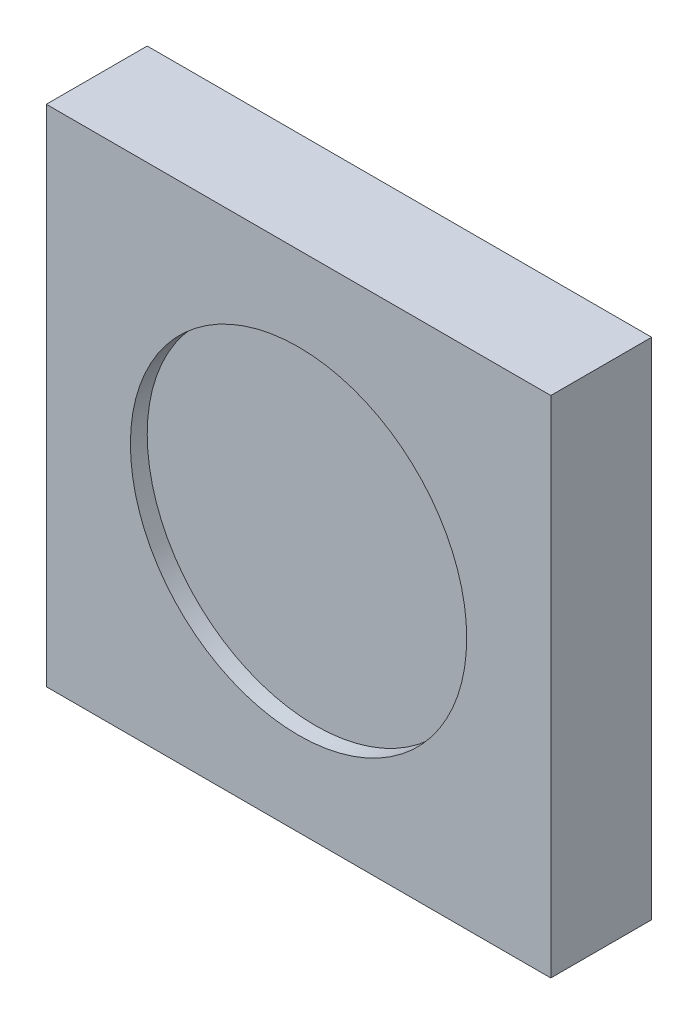
ISO-10303-21;
HEADER;
FILE_DESCRIPTION(('STEP AP214'),'2;1');
FILE_NAME('part.step','',(''),(''),'','','');
FILE_SCHEMA(('AUTOMOTIVE_DESIGN { 1 0 10303 214 1 1 1 1 }'));
ENDSEC;
DATA;
#1=APPLICATION_CONTEXT('core data for automotive mechanical design processes');
#2=APPLICATION_PROTOCOL_DEFINITION('international standard','automotive_design',2000,#1);
#3=PRODUCT_CONTEXT('',#1,'mechanical');
#4=PRODUCT('Part','Part','',(#3));
#5=PRODUCT_RELATED_PRODUCT_CATEGORY('part','',(#4));
#6=PRODUCT_DEFINITION_FORMATION('','',#4);
#7=PRODUCT_DEFINITION_CONTEXT('part definition',#1,'design');
#8=PRODUCT_DEFINITION('design','',#6,#7);
#9=PRODUCT_DEFINITION_SHAPE('','',#8);
#10=(LENGTH_UNIT() NAMED_UNIT(*) SI_UNIT(.MILLI.,.METRE.));
#11=(NAMED_UNIT(*) PLANE_ANGLE_UNIT() SI_UNIT($,.RADIAN.));
#12=(NAMED_UNIT(*) SI_UNIT($,.STERADIAN.) SOLID_ANGLE_UNIT());
#13=UNCERTAINTY_MEASURE_WITH_UNIT(LENGTH_MEASURE(1.E-05),#10,'distance_accuracy_value','');
#14=(GEOMETRIC_REPRESENTATION_CONTEXT(3) GLOBAL_UNCERTAINTY_ASSIGNED_CONTEXT((#13)) GLOBAL_UNIT_ASSIGNED_CONTEXT((#10,
#11,#12)) REPRESENTATION_CONTEXT('',''));
#15=CARTESIAN_POINT('',(0.,0.,0.));
#16=DIRECTION('',(0.,0.,1.));
#17=DIRECTION('',(1.,0.,0.));
#18=AXIS2_PLACEMENT_3D('',#15,#16,#17);
#19=CARTESIAN_POINT('',(-169.212810174458,34.7545635375068,6.));
#20=DIRECTION('',(1.,0.,0.));
#21=DIRECTION('',(0.,0.,-1.));
#22=AXIS2_PLACEMENT_3D('',#19,#20,#21);
#23=PLANE('',#22);
#24=DIRECTION('',(0.,-1.,0.));
#25=VECTOR('',#24,1.);
#26=CARTESIAN_POINT('',(-169.212810174458,34.7545635375068,0.));
#27=LINE('',#26,#25);
#28=CARTESIAN_POINT('',(-169.212810174458,34.7545635375068,0.));
#29=VERTEX_POINT('',#28);
#30=CARTESIAN_POINT('',(-169.212810174458,4.75456353750676,0.));
#31=VERTEX_POINT('',#30);
#32=EDGE_CURVE('E102',#29,#31,#27,.T.);
#33=ORIENTED_EDGE('',*,*,#32,.T.);
#34=DIRECTION('',(0.,0.,-1.));
#35=VECTOR('',#34,1.);
#36=CARTESIAN_POINT('',(-169.212810174458,4.75456353750676,6.));
#37=LINE('',#36,#35);
#38=CARTESIAN_POINT('',(-169.212810174458,4.75456353750676,6.));
#39=VERTEX_POINT('',#38);
#40=EDGE_CURVE('E11',#39,#31,#37,.T.);
#41=ORIENTED_EDGE('',*,*,#40,.F.);
#42=DIRECTION('',(0.,-1.,0.));
#43=VECTOR('',#42,1.);
#44=CARTESIAN_POINT('',(-169.212810174458,34.7545635375068,6.));
#45=LINE('',#44,#43);
#46=CARTESIAN_POINT('',(-169.212810174458,34.7545635375068,6.));
#47=VERTEX_POINT('',#46);
#48=EDGE_CURVE('E90',#47,#39,#45,.T.);
#49=ORIENTED_EDGE('',*,*,#48,.F.);
#50=DIRECTION('',(0.,0.,-1.));
#51=VECTOR('',#50,1.);
#52=CARTESIAN_POINT('',(-169.212810174458,34.7545635375068,6.));
#53=LINE('',#52,#51);
#54=EDGE_CURVE('E98',#47,#29,#53,.T.);
#55=ORIENTED_EDGE('',*,*,#54,.T.);
#56=EDGE_LOOP('',(#33,#41,#49,#55));
#57=FACE_BOUND('',#56,.T.);
#58=ADVANCED_FACE('F39',(#57),#23,.F.);
#59=CARTESIAN_POINT('',(-169.212810174458,4.75456353750676,6.));
#60=DIRECTION('',(0.,1.,0.));
#61=DIRECTION('',(0.,0.,1.));
#62=AXIS2_PLACEMENT_3D('',#59,#60,#61);
#63=PLANE('',#62);
#64=DIRECTION('',(1.,0.,0.));
#65=VECTOR('',#64,1.);
#66=CARTESIAN_POINT('',(-169.212810174458,4.75456353750676,0.));
#67=LINE('',#66,#65);
#68=CARTESIAN_POINT('',(-139.212810174458,4.75456353750676,0.));
#69=VERTEX_POINT('',#68);
#70=EDGE_CURVE('E94',#31,#69,#67,.T.);
#71=ORIENTED_EDGE('',*,*,#70,.T.);
#72=DIRECTION('',(0.,0.,-1.));
#73=VECTOR('',#72,1.);
#74=CARTESIAN_POINT('',(-139.212810174458,4.75456353750676,6.));
#75=LINE('',#74,#73);
#76=CARTESIAN_POINT('',(-139.212810174458,4.75456353750676,6.));
#77=VERTEX_POINT('',#76);
#78=EDGE_CURVE('E47',#77,#69,#75,.T.);
#79=ORIENTED_EDGE('',*,*,#78,.F.);
#80=DIRECTION('',(1.,0.,0.));
#81=VECTOR('',#80,1.);
#82=CARTESIAN_POINT('',(-169.212810174458,4.75456353750676,6.));
#83=LINE('',#82,#81);
#84=EDGE_CURVE('E85',#39,#77,#83,.T.);
#85=ORIENTED_EDGE('',*,*,#84,.F.);
#86=ORIENTED_EDGE('',*,*,#40,.T.);
#87=EDGE_LOOP('',(#71,#79,#85,#86));
#88=FACE_BOUND('',#87,.T.);
#89=ADVANCED_FACE('F93',(#88),#63,.F.);
#90=CARTESIAN_POINT('',(-139.212810174458,34.7545635375068,6.));
#91=DIRECTION('',(-1.,0.,0.));
#92=DIRECTION('',(0.,0.,1.));
#93=AXIS2_PLACEMENT_3D('',#90,#91,#92);
#94=PLANE('',#93);
#95=DIRECTION('',(0.,1.,0.));
#96=VECTOR('',#95,1.);
#97=CARTESIAN_POINT('',(-139.212810174458,34.7545635375068,0.));
#98=LINE('',#97,#96);
#99=CARTESIAN_POINT('',(-139.212810174458,34.7545635375068,0.));
#100=VERTEX_POINT('',#99);
#101=EDGE_CURVE('E72',#69,#100,#98,.T.);
#102=ORIENTED_EDGE('',*,*,#101,.T.);
#103=DIRECTION('',(0.,0.,-1.));
#104=VECTOR('',#103,1.);
#105=CARTESIAN_POINT('',(-139.212810174458,34.7545635375068,6.));
#106=LINE('',#105,#104);
#107=CARTESIAN_POINT('',(-139.212810174458,34.7545635375068,6.));
#108=VERTEX_POINT('',#107);
#109=EDGE_CURVE('E95',#108,#100,#106,.T.);
#110=ORIENTED_EDGE('',*,*,#109,.F.);
#111=DIRECTION('',(0.,1.,0.));
#112=VECTOR('',#111,1.);
#113=CARTESIAN_POINT('',(-139.212810174458,34.7545635375068,6.));
#114=LINE('',#113,#112);
#115=EDGE_CURVE('E88',#77,#108,#114,.T.);
#116=ORIENTED_EDGE('',*,*,#115,.F.);
#117=ORIENTED_EDGE('',*,*,#78,.T.);
#118=EDGE_LOOP('',(#102,#110,#116,#117));
#119=FACE_BOUND('',#118,.T.);
#120=ADVANCED_FACE('F96',(#119),#94,.F.);
#121=CARTESIAN_POINT('',(-169.212810174458,34.7545635375068,6.));
#122=DIRECTION('',(0.,-1.,0.));
#123=DIRECTION('',(0.,0.,-1.));
#124=AXIS2_PLACEMENT_3D('',#121,#122,#123);
#125=PLANE('',#124);
#126=DIRECTION('',(-1.,0.,0.));
#127=VECTOR('',#126,1.);
#128=CARTESIAN_POINT('',(-169.212810174458,34.7545635375068,0.));
#129=LINE('',#128,#127);
#130=EDGE_CURVE('E78',#100,#29,#129,.T.);
#131=ORIENTED_EDGE('',*,*,#130,.T.);
#132=ORIENTED_EDGE('',*,*,#54,.F.);
#133=DIRECTION('',(-1.,0.,0.));
#134=VECTOR('',#133,1.);
#135=CARTESIAN_POINT('',(-169.212810174458,34.7545635375068,6.));
#136=LINE('',#135,#134);
#137=EDGE_CURVE('E55',#108,#47,#136,.T.);
#138=ORIENTED_EDGE('',*,*,#137,.F.);
#139=ORIENTED_EDGE('',*,*,#109,.T.);
#140=EDGE_LOOP('',(#131,#132,#138,#139));
#141=FACE_BOUND('',#140,.T.);
#142=ADVANCED_FACE('F110',(#141),#125,.F.);
#143=CARTESIAN_POINT('',(0.,0.,6.));
#144=DIRECTION('',(0.,0.,1.));
#145=DIRECTION('',(1.,0.,0.));
#146=AXIS2_PLACEMENT_3D('',#143,#144,#145);
#147=PLANE('',#146);
#148=CARTESIAN_POINT('',(-154.212810174458,19.7545635375068,6.));
#149=DIRECTION('',(0.,0.,1.));
#150=DIRECTION('',(1.,0.,0.));
#151=AXIS2_PLACEMENT_3D('',#148,#149,#150);
#152=CIRCLE('',#151,10.);
#153=CARTESIAN_POINT('',(-144.212810174458,19.7545635375068,6.));
#154=VERTEX_POINT('',#153);
#155=EDGE_CURVE('E116',#154,#154,#152,.T.);
#156=ORIENTED_EDGE('',*,*,#155,.F.);
#157=EDGE_LOOP('',(#156));
#158=FACE_BOUND('',#157,.T.);
#159=ORIENTED_EDGE('',*,*,#48,.T.);
#160=ORIENTED_EDGE('',*,*,#84,.T.);
#161=ORIENTED_EDGE('',*,*,#115,.T.);
#162=ORIENTED_EDGE('',*,*,#137,.T.);
#163=EDGE_LOOP('',(#159,#160,#161,#162));
#164=FACE_BOUND('',#163,.T.);
#165=ADVANCED_FACE('F86',(#158,#164),#147,.T.);
#166=CARTESIAN_POINT('',(0.,0.,0.));
#167=DIRECTION('',(0.,0.,1.));
#168=DIRECTION('',(1.,0.,0.));
#169=AXIS2_PLACEMENT_3D('',#166,#167,#168);
#170=PLANE('',#169);
#171=ORIENTED_EDGE('',*,*,#32,.F.);
#172=ORIENTED_EDGE('',*,*,#130,.F.);
#173=ORIENTED_EDGE('',*,*,#101,.F.);
#174=ORIENTED_EDGE('',*,*,#70,.F.);
#175=EDGE_LOOP('',(#171,#172,#173,#174));
#176=FACE_BOUND('',#175,.T.);
#177=ADVANCED_FACE('F113',(#176),#170,.F.);
#178=CARTESIAN_POINT('',(-154.212810174458,19.7545635375068,5.));
#179=DIRECTION('',(0.,0.,1.));
#180=DIRECTION('',(1.,0.,0.));
#181=AXIS2_PLACEMENT_3D('',#178,#179,#180);
#182=CYLINDRICAL_SURFACE('',#181,10.);
#183=CARTESIAN_POINT('',(-154.212810174458,19.7545635375068,5.));
#184=DIRECTION('',(0.,0.,1.));
#185=DIRECTION('',(1.,0.,0.));
#186=AXIS2_PLACEMENT_3D('',#183,#184,#185);
#187=CIRCLE('',#186,10.);
#188=CARTESIAN_POINT('',(-144.212810174458,19.7545635375068,5.));
#189=VERTEX_POINT('',#188);
#190=EDGE_CURVE('E105',#189,#189,#187,.T.);
#191=ORIENTED_EDGE('',*,*,#190,.F.);
#192=EDGE_LOOP('',(#191));
#193=FACE_BOUND('',#192,.T.);
#194=ORIENTED_EDGE('',*,*,#155,.T.);
#195=EDGE_LOOP('',(#194));
#196=FACE_BOUND('',#195,.T.);
#197=ADVANCED_FACE('F124',(#193,#196),#182,.F.);
#198=CARTESIAN_POINT('',(-154.212810174458,19.7545635375068,5.));
#199=DIRECTION('',(0.,0.,1.));
#200=DIRECTION('',(1.,0.,0.));
#201=AXIS2_PLACEMENT_3D('',#198,#199,#200);
#202=PLANE('',#201);
#203=ORIENTED_EDGE('',*,*,#190,.T.);
#204=EDGE_LOOP('',(#203));
#205=FACE_BOUND('',#204,.T.);
#206=ADVANCED_FACE('F122',(#205),#202,.T.);
#207=CLOSED_SHELL('',(#58,#89,#120,#142,#165,#177,#197,#206));
#208=MANIFOLD_SOLID_BREP('B2',#207);
#209=ADVANCED_BREP_SHAPE_REPRESENTATION('',(#18,#208),#14);
#210=SHAPE_DEFINITION_REPRESENTATION(#9,#209);
ENDSEC;
END-ISO-10303-21;
